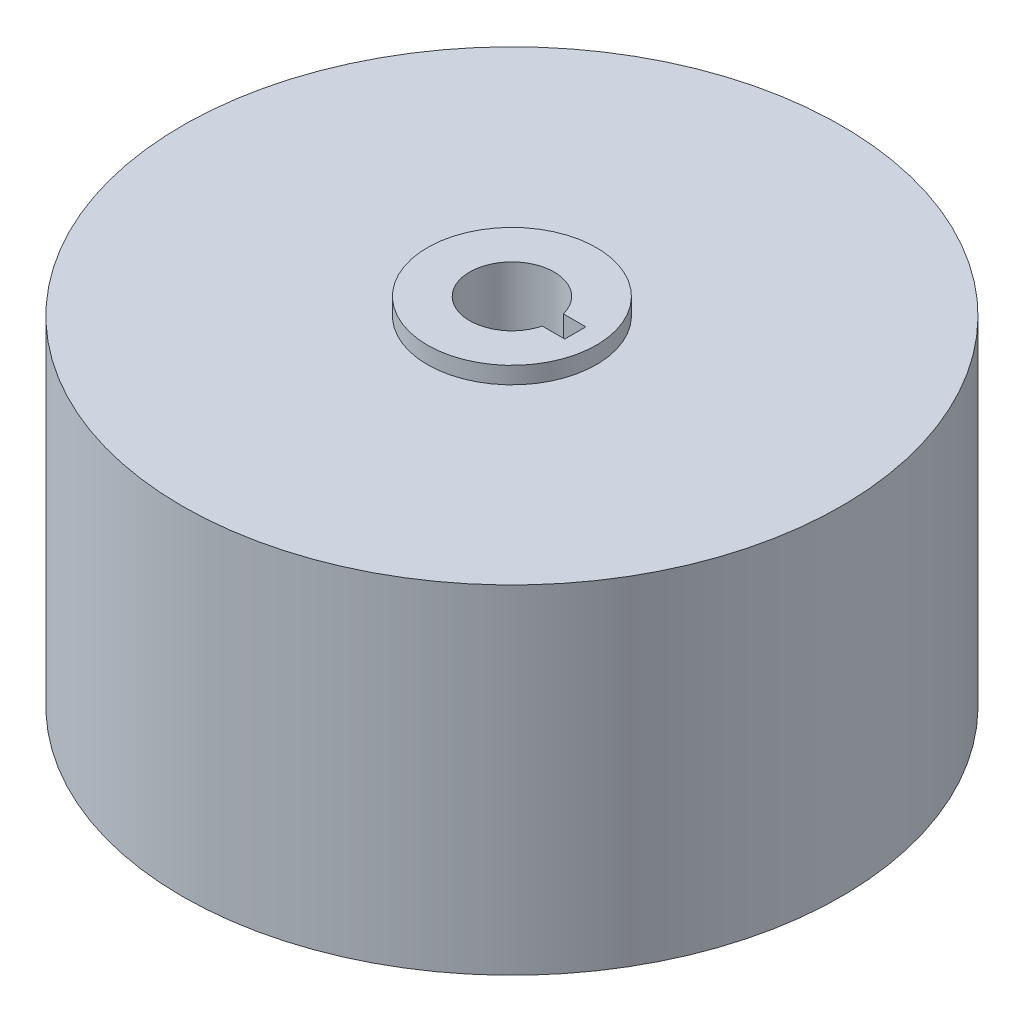
ISO-10303-21;
HEADER;
FILE_DESCRIPTION(('STEP AP214'),'2;1');
FILE_NAME('part.step','',(''),(''),'','','');
FILE_SCHEMA(('AUTOMOTIVE_DESIGN { 1 0 10303 214 1 1 1 1 }'));
ENDSEC;
DATA;
#1=APPLICATION_CONTEXT('core data for automotive mechanical design processes');
#2=APPLICATION_PROTOCOL_DEFINITION('international standard','automotive_design',2000,#1);
#3=PRODUCT_CONTEXT('',#1,'mechanical');
#4=PRODUCT('Part','Part','',(#3));
#5=PRODUCT_RELATED_PRODUCT_CATEGORY('part','',(#4));
#6=PRODUCT_DEFINITION_FORMATION('','',#4);
#7=PRODUCT_DEFINITION_CONTEXT('part definition',#1,'design');
#8=PRODUCT_DEFINITION('design','',#6,#7);
#9=PRODUCT_DEFINITION_SHAPE('','',#8);
#10=(LENGTH_UNIT() NAMED_UNIT(*) SI_UNIT(.MILLI.,.METRE.));
#11=(NAMED_UNIT(*) PLANE_ANGLE_UNIT() SI_UNIT($,.RADIAN.));
#12=(NAMED_UNIT(*) SI_UNIT($,.STERADIAN.) SOLID_ANGLE_UNIT());
#13=UNCERTAINTY_MEASURE_WITH_UNIT(LENGTH_MEASURE(1.E-05),#10,'distance_accuracy_value','');
#14=(GEOMETRIC_REPRESENTATION_CONTEXT(3) GLOBAL_UNCERTAINTY_ASSIGNED_CONTEXT((#13)) GLOBAL_UNIT_ASSIGNED_CONTEXT((#10,
#11,#12)) REPRESENTATION_CONTEXT('',''));
#15=CARTESIAN_POINT('',(0.,0.,0.));
#16=DIRECTION('',(0.,0.,1.));
#17=DIRECTION('',(1.,0.,0.));
#18=AXIS2_PLACEMENT_3D('',#15,#16,#17);
#19=CARTESIAN_POINT('',(0.,40.,0.));
#20=DIRECTION('',(0.,-1.,0.));
#21=DIRECTION('',(0.,0.,-1.));
#22=AXIS2_PLACEMENT_3D('',#19,#20,#21);
#23=CYLINDRICAL_SURFACE('',#22,39.);
#24=CARTESIAN_POINT('',(0.,40.,0.));
#25=DIRECTION('',(0.,1.,0.));
#26=DIRECTION('',(0.,0.,1.));
#27=AXIS2_PLACEMENT_3D('',#24,#25,#26);
#28=CIRCLE('',#27,39.);
#29=CARTESIAN_POINT('',(0.,40.,39.));
#30=VERTEX_POINT('',#29);
#31=EDGE_CURVE('E110',#30,#30,#28,.T.);
#32=ORIENTED_EDGE('',*,*,#31,.F.);
#33=EDGE_LOOP('',(#32));
#34=FACE_BOUND('',#33,.T.);
#35=CARTESIAN_POINT('',(0.,0.,0.));
#36=DIRECTION('',(0.,1.,0.));
#37=DIRECTION('',(0.,0.,1.));
#38=AXIS2_PLACEMENT_3D('',#35,#36,#37);
#39=CIRCLE('',#38,39.);
#40=CARTESIAN_POINT('',(0.,0.,39.));
#41=VERTEX_POINT('',#40);
#42=EDGE_CURVE('E113',#41,#41,#39,.T.);
#43=ORIENTED_EDGE('',*,*,#42,.T.);
#44=EDGE_LOOP('',(#43));
#45=FACE_BOUND('',#44,.T.);
#46=ADVANCED_FACE('F32',(#34,#45),#23,.T.);
#47=CARTESIAN_POINT('',(0.,40.,0.));
#48=DIRECTION('',(0.,1.,0.));
#49=DIRECTION('',(0.,0.,1.));
#50=AXIS2_PLACEMENT_3D('',#47,#48,#49);
#51=PLANE('',#50);
#52=CARTESIAN_POINT('',(0.,40.,0.));
#53=DIRECTION('',(0.,1.,0.));
#54=DIRECTION('',(0.,0.,1.));
#55=AXIS2_PLACEMENT_3D('',#52,#53,#54);
#56=CIRCLE('',#55,10.);
#57=CARTESIAN_POINT('',(0.,40.,10.));
#58=VERTEX_POINT('',#57);
#59=EDGE_CURVE('E107',#58,#58,#56,.T.);
#60=ORIENTED_EDGE('',*,*,#59,.F.);
#61=EDGE_LOOP('',(#60));
#62=FACE_BOUND('',#61,.T.);
#63=ORIENTED_EDGE('',*,*,#31,.T.);
#64=EDGE_LOOP('',(#63));
#65=FACE_BOUND('',#64,.T.);
#66=ADVANCED_FACE('F137',(#62,#65),#51,.T.);
#67=CARTESIAN_POINT('',(0.,0.,0.));
#68=DIRECTION('',(0.,1.,0.));
#69=DIRECTION('',(0.,0.,1.));
#70=AXIS2_PLACEMENT_3D('',#67,#68,#69);
#71=PLANE('',#70);
#72=CARTESIAN_POINT('',(0.,0.,0.));
#73=DIRECTION('',(0.,1.,0.));
#74=DIRECTION('',(0.,0.,1.));
#75=AXIS2_PLACEMENT_3D('',#72,#73,#74);
#76=CIRCLE('',#75,10.);
#77=CARTESIAN_POINT('',(0.,0.,10.));
#78=VERTEX_POINT('',#77);
#79=EDGE_CURVE('E106',#78,#78,#76,.T.);
#80=ORIENTED_EDGE('',*,*,#79,.T.);
#81=EDGE_LOOP('',(#80));
#82=FACE_BOUND('',#81,.T.);
#83=ORIENTED_EDGE('',*,*,#42,.F.);
#84=EDGE_LOOP('',(#83));
#85=FACE_BOUND('',#84,.T.);
#86=ADVANCED_FACE('F142',(#82,#85),#71,.F.);
#87=CARTESIAN_POINT('',(0.,-2.,0.));
#88=DIRECTION('',(0.,1.,0.));
#89=DIRECTION('',(0.,0.,1.));
#90=AXIS2_PLACEMENT_3D('',#87,#88,#89);
#91=PLANE('',#90);
#92=CARTESIAN_POINT('',(0.,-2.,0.));
#93=DIRECTION('',(0.,1.,0.));
#94=DIRECTION('',(0.,0.,1.));
#95=AXIS2_PLACEMENT_3D('',#92,#93,#94);
#96=CIRCLE('',#95,5.);
#97=CARTESIAN_POINT('',(4.84122918275927,-2.,-1.25));
#98=VERTEX_POINT('',#97);
#99=CARTESIAN_POINT('',(4.84122918275927,-2.,1.25));
#100=VERTEX_POINT('',#99);
#101=EDGE_CURVE('E96',#98,#100,#96,.T.);
#102=ORIENTED_EDGE('',*,*,#101,.T.);
#103=DIRECTION('',(1.,0.,0.));
#104=VECTOR('',#103,1.);
#105=CARTESIAN_POINT('',(2.5,-2.,1.25));
#106=LINE('',#105,#104);
#107=CARTESIAN_POINT('',(7.5,-2.,1.25));
#108=VERTEX_POINT('',#107);
#109=EDGE_CURVE('E79',#100,#108,#106,.T.);
#110=ORIENTED_EDGE('',*,*,#109,.T.);
#111=DIRECTION('',(0.,0.,-1.));
#112=VECTOR('',#111,1.);
#113=CARTESIAN_POINT('',(7.5,-2.,-1.25));
#114=LINE('',#113,#112);
#115=CARTESIAN_POINT('',(7.5,-2.,-1.25));
#116=VERTEX_POINT('',#115);
#117=EDGE_CURVE('E74',#108,#116,#114,.T.);
#118=ORIENTED_EDGE('',*,*,#117,.T.);
#119=DIRECTION('',(-1.,0.,0.));
#120=VECTOR('',#119,1.);
#121=CARTESIAN_POINT('',(2.5,-2.,-1.25));
#122=LINE('',#121,#120);
#123=EDGE_CURVE('E81',#116,#98,#122,.T.);
#124=ORIENTED_EDGE('',*,*,#123,.T.);
#125=EDGE_LOOP('',(#102,#110,#118,#124));
#126=FACE_BOUND('',#125,.T.);
#127=CARTESIAN_POINT('',(0.,-2.,0.));
#128=DIRECTION('',(0.,1.,0.));
#129=DIRECTION('',(0.,0.,1.));
#130=AXIS2_PLACEMENT_3D('',#127,#128,#129);
#131=CIRCLE('',#130,10.);
#132=CARTESIAN_POINT('',(0.,-2.,10.));
#133=VERTEX_POINT('',#132);
#134=EDGE_CURVE('E103',#133,#133,#131,.T.);
#135=ORIENTED_EDGE('',*,*,#134,.F.);
#136=EDGE_LOOP('',(#135));
#137=FACE_BOUND('',#136,.T.);
#138=ADVANCED_FACE('F87',(#126,#137),#91,.F.);
#139=CARTESIAN_POINT('',(0.,-2.,0.));
#140=DIRECTION('',(0.,1.,0.));
#141=DIRECTION('',(0.,0.,1.));
#142=AXIS2_PLACEMENT_3D('',#139,#140,#141);
#143=CYLINDRICAL_SURFACE('',#142,10.);
#144=ORIENTED_EDGE('',*,*,#134,.T.);
#145=EDGE_LOOP('',(#144));
#146=FACE_BOUND('',#145,.T.);
#147=ORIENTED_EDGE('',*,*,#79,.F.);
#148=EDGE_LOOP('',(#147));
#149=FACE_BOUND('',#148,.T.);
#150=ADVANCED_FACE('F154',(#146,#149),#143,.T.);
#151=ORIENTED_EDGE('',*,*,#59,.T.);
#152=EDGE_LOOP('',(#151));
#153=FACE_BOUND('',#152,.T.);
#154=CARTESIAN_POINT('',(0.,42.,0.));
#155=DIRECTION('',(0.,1.,0.));
#156=DIRECTION('',(0.,0.,1.));
#157=AXIS2_PLACEMENT_3D('',#154,#155,#156);
#158=CIRCLE('',#157,10.);
#159=CARTESIAN_POINT('',(0.,42.,10.));
#160=VERTEX_POINT('',#159);
#161=EDGE_CURVE('E100',#160,#160,#158,.T.);
#162=ORIENTED_EDGE('',*,*,#161,.F.);
#163=EDGE_LOOP('',(#162));
#164=FACE_BOUND('',#163,.T.);
#165=ADVANCED_FACE('F157',(#153,#164),#143,.T.);
#166=CARTESIAN_POINT('',(0.,42.,0.));
#167=DIRECTION('',(0.,1.,0.));
#168=DIRECTION('',(0.,0.,1.));
#169=AXIS2_PLACEMENT_3D('',#166,#167,#168);
#170=PLANE('',#169);
#171=DIRECTION('',(1.,0.,0.));
#172=VECTOR('',#171,1.);
#173=CARTESIAN_POINT('',(2.5,42.,1.25));
#174=LINE('',#173,#172);
#175=CARTESIAN_POINT('',(4.84122918275927,42.,1.25));
#176=VERTEX_POINT('',#175);
#177=CARTESIAN_POINT('',(7.5,42.,1.25));
#178=VERTEX_POINT('',#177);
#179=EDGE_CURVE('E89',#176,#178,#174,.T.);
#180=ORIENTED_EDGE('',*,*,#179,.F.);
#181=CARTESIAN_POINT('',(0.,42.,0.));
#182=DIRECTION('',(0.,1.,0.));
#183=DIRECTION('',(0.,0.,1.));
#184=AXIS2_PLACEMENT_3D('',#181,#182,#183);
#185=CIRCLE('',#184,5.);
#186=CARTESIAN_POINT('',(4.84122918275927,42.,-1.25));
#187=VERTEX_POINT('',#186);
#188=EDGE_CURVE('E99',#187,#176,#185,.T.);
#189=ORIENTED_EDGE('',*,*,#188,.F.);
#190=DIRECTION('',(-1.,0.,0.));
#191=VECTOR('',#190,1.);
#192=CARTESIAN_POINT('',(2.5,42.,-1.25));
#193=LINE('',#192,#191);
#194=CARTESIAN_POINT('',(7.5,42.,-1.25));
#195=VERTEX_POINT('',#194);
#196=EDGE_CURVE('E46',#195,#187,#193,.T.);
#197=ORIENTED_EDGE('',*,*,#196,.F.);
#198=DIRECTION('',(0.,0.,-1.));
#199=VECTOR('',#198,1.);
#200=CARTESIAN_POINT('',(7.5,42.,-1.25));
#201=LINE('',#200,#199);
#202=EDGE_CURVE('E77',#178,#195,#201,.T.);
#203=ORIENTED_EDGE('',*,*,#202,.F.);
#204=EDGE_LOOP('',(#180,#189,#197,#203));
#205=FACE_BOUND('',#204,.T.);
#206=ORIENTED_EDGE('',*,*,#161,.T.);
#207=EDGE_LOOP('',(#206));
#208=FACE_BOUND('',#207,.T.);
#209=ADVANCED_FACE('F124',(#205,#208),#170,.T.);
#210=CARTESIAN_POINT('',(0.,-2.,0.));
#211=DIRECTION('',(0.,1.,0.));
#212=DIRECTION('',(0.,0.,1.));
#213=AXIS2_PLACEMENT_3D('',#210,#211,#212);
#214=CYLINDRICAL_SURFACE('',#213,5.);
#215=ORIENTED_EDGE('',*,*,#188,.T.);
#216=DIRECTION('',(0.,1.,0.));
#217=VECTOR('',#216,1.);
#218=CARTESIAN_POINT('',(4.84122918275927,-2.,1.25));
#219=LINE('',#218,#217);
#220=EDGE_CURVE('E11',#176,#100,#219,.F.);
#221=ORIENTED_EDGE('',*,*,#220,.T.);
#222=ORIENTED_EDGE('',*,*,#101,.F.);
#223=DIRECTION('',(0.,1.,0.));
#224=VECTOR('',#223,1.);
#225=CARTESIAN_POINT('',(4.84122918275927,-2.,-1.25));
#226=LINE('',#225,#224);
#227=EDGE_CURVE('E39',#98,#187,#226,.T.);
#228=ORIENTED_EDGE('',*,*,#227,.T.);
#229=EDGE_LOOP('',(#215,#221,#222,#228));
#230=FACE_BOUND('',#229,.T.);
#231=ADVANCED_FACE('F121',(#230),#214,.F.);
#232=CARTESIAN_POINT('',(2.5,-2.,1.25));
#233=DIRECTION('',(0.,0.,1.));
#234=DIRECTION('',(1.,0.,0.));
#235=AXIS2_PLACEMENT_3D('',#232,#233,#234);
#236=PLANE('',#235);
#237=ORIENTED_EDGE('',*,*,#179,.T.);
#238=DIRECTION('',(0.,1.,0.));
#239=VECTOR('',#238,1.);
#240=CARTESIAN_POINT('',(7.5,-2.,1.25));
#241=LINE('',#240,#239);
#242=EDGE_CURVE('E78',#108,#178,#241,.T.);
#243=ORIENTED_EDGE('',*,*,#242,.F.);
#244=ORIENTED_EDGE('',*,*,#109,.F.);
#245=ORIENTED_EDGE('',*,*,#220,.F.);
#246=EDGE_LOOP('',(#237,#243,#244,#245));
#247=FACE_BOUND('',#246,.T.);
#248=ADVANCED_FACE('F127',(#247),#236,.F.);
#249=CARTESIAN_POINT('',(2.5,-2.,-1.25));
#250=DIRECTION('',(0.,0.,-1.));
#251=DIRECTION('',(-1.,0.,0.));
#252=AXIS2_PLACEMENT_3D('',#249,#250,#251);
#253=PLANE('',#252);
#254=ORIENTED_EDGE('',*,*,#123,.F.);
#255=DIRECTION('',(0.,1.,0.));
#256=VECTOR('',#255,1.);
#257=CARTESIAN_POINT('',(7.5,-2.,-1.25));
#258=LINE('',#257,#256);
#259=EDGE_CURVE('E70',#116,#195,#258,.T.);
#260=ORIENTED_EDGE('',*,*,#259,.T.);
#261=ORIENTED_EDGE('',*,*,#196,.T.);
#262=ORIENTED_EDGE('',*,*,#227,.F.);
#263=EDGE_LOOP('',(#254,#260,#261,#262));
#264=FACE_BOUND('',#263,.T.);
#265=ADVANCED_FACE('F82',(#264),#253,.F.);
#266=CARTESIAN_POINT('',(7.5,-2.,-1.25));
#267=DIRECTION('',(1.,0.,0.));
#268=DIRECTION('',(0.,0.,-1.));
#269=AXIS2_PLACEMENT_3D('',#266,#267,#268);
#270=PLANE('',#269);
#271=ORIENTED_EDGE('',*,*,#202,.T.);
#272=ORIENTED_EDGE('',*,*,#259,.F.);
#273=ORIENTED_EDGE('',*,*,#117,.F.);
#274=ORIENTED_EDGE('',*,*,#242,.T.);
#275=EDGE_LOOP('',(#271,#272,#273,#274));
#276=FACE_BOUND('',#275,.T.);
#277=ADVANCED_FACE('F71',(#276),#270,.F.);
#278=CLOSED_SHELL('',(#46,#66,#86,#138,#150,#165,#209,#231,#248,#265,#277));
#279=MANIFOLD_SOLID_BREP('B2',#278);
#280=ADVANCED_BREP_SHAPE_REPRESENTATION('',(#18,#279),#14);
#281=SHAPE_DEFINITION_REPRESENTATION(#9,#280);
ENDSEC;
END-ISO-10303-21;
